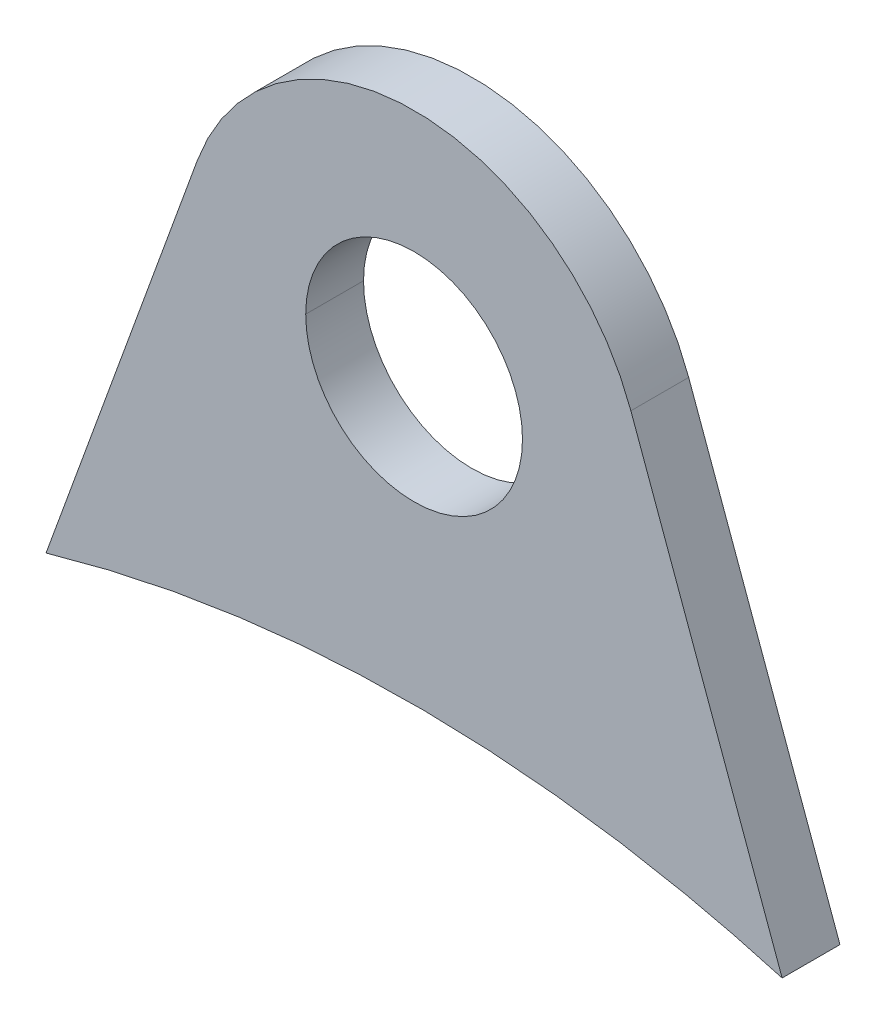
ISO-10303-21;
HEADER;
FILE_DESCRIPTION(('STEP AP214'),'2;1');
FILE_NAME('part.step','',(''),(''),'','','');
FILE_SCHEMA(('AUTOMOTIVE_DESIGN { 1 0 10303 214 1 1 1 1 }'));
ENDSEC;
DATA;
#1=APPLICATION_CONTEXT('core data for automotive mechanical design processes');
#2=APPLICATION_PROTOCOL_DEFINITION('international standard','automotive_design',2000,#1);
#3=PRODUCT_CONTEXT('',#1,'mechanical');
#4=PRODUCT('Part','Part','',(#3));
#5=PRODUCT_RELATED_PRODUCT_CATEGORY('part','',(#4));
#6=PRODUCT_DEFINITION_FORMATION('','',#4);
#7=PRODUCT_DEFINITION_CONTEXT('part definition',#1,'design');
#8=PRODUCT_DEFINITION('design','',#6,#7);
#9=PRODUCT_DEFINITION_SHAPE('','',#8);
#10=(LENGTH_UNIT() NAMED_UNIT(*) SI_UNIT(.MILLI.,.METRE.));
#11=(NAMED_UNIT(*) PLANE_ANGLE_UNIT() SI_UNIT($,.RADIAN.));
#12=(NAMED_UNIT(*) SI_UNIT($,.STERADIAN.) SOLID_ANGLE_UNIT());
#13=UNCERTAINTY_MEASURE_WITH_UNIT(LENGTH_MEASURE(1.E-05),#10,'distance_accuracy_value','');
#14=(GEOMETRIC_REPRESENTATION_CONTEXT(3) GLOBAL_UNCERTAINTY_ASSIGNED_CONTEXT((#13)) GLOBAL_UNIT_ASSIGNED_CONTEXT((#10,
#11,#12)) REPRESENTATION_CONTEXT('',''));
#15=CARTESIAN_POINT('',(0.,0.,0.));
#16=DIRECTION('',(0.,0.,1.));
#17=DIRECTION('',(1.,0.,0.));
#18=AXIS2_PLACEMENT_3D('',#15,#16,#17);
#19=CARTESIAN_POINT('',(237.51196147364,-296.982955426362,4.8884324645745E-12));
#20=DIRECTION('',(0.689605532614526,0.72418520378936,0.));
#21=DIRECTION('',(-0.512076268434414,0.487624748455489,-0.707106781186553));
#22=AXIS2_PLACEMENT_3D('',#19,#20,#21);
#23=TOROIDAL_SURFACE('',#22,328.,181.5);
#24=CARTESIAN_POINT('',(50.7061588567481,103.465463207246,4.));
#25=CARTESIAN_POINT('',(50.8043560138858,103.439726310506,3.38985638226352));
#26=CARTESIAN_POINT('',(50.8800297766225,103.419816936708,2.77674567943645));
#27=CARTESIAN_POINT('',(50.9331187111239,103.405836050411,2.16065704182647));
#28=(BOUNDED_CURVE() B_SPLINE_CURVE(3,(#24,#25,#26,#27),.UNSPECIFIED.,.F.,
.F.) B_SPLINE_CURVE_WITH_KNOTS((4,4),(2.02602846316663E-07,0.00185445411884371),
.UNSPECIFIED.) CURVE() GEOMETRIC_REPRESENTATION_ITEM() RATIONAL_B_SPLINE_CURVE((1.,1.,1.,1.)) REPRESENTATION_ITEM(''));
#29=CARTESIAN_POINT('',(50.706158856748,103.465463207245,3.99999999999996));
#30=VERTEX_POINT('',#29);
#31=CARTESIAN_POINT('',(50.9331187111239,103.405836050411,2.16065704182647));
#32=VERTEX_POINT('',#31);
#33=EDGE_CURVE('E191',#30,#32,#28,.T.);
#34=ORIENTED_EDGE('',*,*,#33,.F.);
#35=CARTESIAN_POINT('',(-50.9331187111229,103.405836050412,3.99999999999993));
#36=CARTESIAN_POINT('',(-48.4554874316051,104.130085725674,3.99999999999993));
#37=CARTESIAN_POINT('',(-45.962388443714,104.801410169952,3.99999999999993));
#38=CARTESIAN_POINT('',(-40.9498127506451,106.037145102481,3.99999999999993));
#39=CARTESIAN_POINT('',(-38.4303358460193,106.601554781713,3.99999999999993));
#40=CARTESIAN_POINT('',(-33.3691560762587,107.622475173788,3.99999999999993));
#41=CARTESIAN_POINT('',(-30.8274493923167,108.078966954496,3.99999999999992));
#42=CARTESIAN_POINT('',(-25.7269015017919,108.883100152258,3.99999999999992));
#43=CARTESIAN_POINT('',(-23.1680604929814,109.230742823496,3.99999999999992));
#44=CARTESIAN_POINT('',(-18.0976552647974,109.809723605772,3.99999999999992));
#45=CARTESIAN_POINT('',(-15.5863785846829,110.043582769014,3.99999999999992));
#46=CARTESIAN_POINT('',(-10.5562643496427,110.406461640258,3.99999999999992));
#47=CARTESIAN_POINT('',(-8.03742680006379,110.53548142238,3.99999999999992));
#48=CARTESIAN_POINT('',(-2.99721715390441,110.688434022884,3.99999999999992));
#49=CARTESIAN_POINT('',(-0.475845909116226,110.712394768461,3.99999999999992));
#50=CARTESIAN_POINT('',(4.56549841829066,110.655276623094,3.99999999999992));
#51=CARTESIAN_POINT('',(7.08547157214515,110.574203694047,3.99999999999992));
#52=CARTESIAN_POINT('',(13.051807129857,110.257706439248,3.99999999999992));
#53=CARTESIAN_POINT('',(16.495835452445,109.976259544864,3.99999999999992));
#54=CARTESIAN_POINT('',(23.3614712063354,109.217399483765,3.99999999999992));
#55=CARTESIAN_POINT('',(26.783082269814,108.740018903233,3.99999999999992));
#56=CARTESIAN_POINT('',(33.6493712780839,107.581388912209,3.99999999999992));
#57=CARTESIAN_POINT('',(37.0935134325297,106.896937551424,3.99999999999992));
#58=CARTESIAN_POINT('',(42.2255157604996,105.721407591173,3.99999999999992));
#59=CARTESIAN_POINT('',(43.9307273137416,105.304683892412,3.99999999999992));
#60=CARTESIAN_POINT('',(47.3283507105477,104.421953788328,3.99999999999992));
#61=CARTESIAN_POINT('',(49.0207625237648,103.955947266198,3.99999999999992));
#62=CARTESIAN_POINT('',(50.7061588567479,103.465463207245,3.99999999999992));
#63=B_SPLINE_CURVE_WITH_KNOTS('',3,(#35,#36,#37,#38,#39,#40,#41,#42,#43,#44,#45,#46,#47,#48,#49,
#50,#51,#52,#53,#54,#55,#56,#57,#58,#59,#60,#61,#62),.UNSPECIFIED.,.F.,.F.,(4,2,2,2,2,2,2,2,2,2,
2,2,2,4),(0.,7.74335816604237,15.4867749233011,23.2315491087713,30.976234053966,
38.5404765295411,46.1047136572073,53.666939908559,61.2287369333531,71.5893154197241,
81.9481715121978,92.4761918431155,97.7417364389047,103.007293514925),.UNSPECIFIED.);
#64=CARTESIAN_POINT('',(-50.9331187111228,103.405836050411,3.99999999999996));
#65=VERTEX_POINT('',#64);
#66=EDGE_CURVE('E21',#65,#30,#63,.T.);
#67=ORIENTED_EDGE('',*,*,#66,.F.);
#68=CARTESIAN_POINT('',(-50.9331187111228,103.405836050412,-4.));
#69=CARTESIAN_POINT('',(-50.925045095001,103.428018128399,-1.33333333333336));
#70=CARTESIAN_POINT('',(-50.925045095001,103.428018128399,1.3333333333333));
#71=CARTESIAN_POINT('',(-50.9331187111227,103.405836050411,4.));
#72=(BOUNDED_CURVE() B_SPLINE_CURVE(3,(#68,#69,#70,#71),.UNSPECIFIED.,.F.,
.F.) B_SPLINE_CURVE_WITH_KNOTS((4,4),(2.00000000005751E-07,0.0080002),
.UNSPECIFIED.) CURVE() GEOMETRIC_REPRESENTATION_ITEM() RATIONAL_B_SPLINE_CURVE((1.,1.,1.,1.)) REPRESENTATION_ITEM(''));
#73=CARTESIAN_POINT('',(-50.9331187111221,103.405836050412,-4.00000000000009));
#74=VERTEX_POINT('',#73);
#75=EDGE_CURVE('E11',#74,#65,#72,.T.);
#76=ORIENTED_EDGE('',*,*,#75,.F.);
#77=CARTESIAN_POINT('',(-50.9331187111227,103.405836050412,-4.00000000000007));
#78=CARTESIAN_POINT('',(-48.455487431605,104.130085725674,-4.00000000000007));
#79=CARTESIAN_POINT('',(-45.9623884437138,104.801410169952,-4.00000000000007));
#80=CARTESIAN_POINT('',(-40.9498127506449,106.037145102481,-4.00000000000007));
#81=CARTESIAN_POINT('',(-38.4303358460191,106.601554781713,-4.00000000000007));
#82=CARTESIAN_POINT('',(-33.3691560762585,107.622475173788,-4.00000000000007));
#83=CARTESIAN_POINT('',(-30.8274493923166,108.078966954496,-4.00000000000008));
#84=CARTESIAN_POINT('',(-25.7269015017917,108.883100152258,-4.00000000000008));
#85=CARTESIAN_POINT('',(-23.1680604929813,109.230742823496,-4.00000000000008));
#86=CARTESIAN_POINT('',(-18.0976552647973,109.809723605772,-4.00000000000008));
#87=CARTESIAN_POINT('',(-15.5863785846828,110.043582769014,-4.00000000000008));
#88=CARTESIAN_POINT('',(-10.5562643496426,110.406461640258,-4.00000000000008));
#89=CARTESIAN_POINT('',(-8.03742680006362,110.53548142238,-4.00000000000008));
#90=CARTESIAN_POINT('',(-2.99721715390422,110.688434022884,-4.00000000000008));
#91=CARTESIAN_POINT('',(-0.47584590911602,110.712394768461,-4.00000000000008));
#92=CARTESIAN_POINT('',(4.56549841829088,110.655276623094,-4.00000000000008));
#93=CARTESIAN_POINT('',(7.08547157214538,110.574203694047,-4.00000000000008));
#94=CARTESIAN_POINT('',(13.0518071298552,110.257706439248,-4.00000000000008));
#95=CARTESIAN_POINT('',(16.495835452441,109.976259544864,-4.00000000000008));
#96=CARTESIAN_POINT('',(23.3614712063273,109.217399483766,-4.00000000000008));
#97=CARTESIAN_POINT('',(26.7830822698038,108.740018903234,-4.00000000000008));
#98=CARTESIAN_POINT('',(33.6493712780695,107.581388912212,-4.00000000000008));
#99=CARTESIAN_POINT('',(37.0935134325131,106.896937551428,-4.00000000000008));
#100=CARTESIAN_POINT('',(42.2255157604799,105.721407591178,-4.00000000000008));
#101=CARTESIAN_POINT('',(43.9307273137209,105.304683892418,-4.00000000000008));
#102=CARTESIAN_POINT('',(47.328350710525,104.421953788334,-4.00000000000008));
#103=CARTESIAN_POINT('',(49.0207625237411,103.955947266204,-4.00000000000008));
#104=CARTESIAN_POINT('',(50.7061588567232,103.465463207252,-4.00000000000008));
#105=B_SPLINE_CURVE_WITH_KNOTS('',3,(#77,#78,#79,#80,#81,#82,#83,#84,#85,#86,#87,#88,#89,#90,
#91,#92,#93,#94,#95,#96,#97,#98,#99,#100,#101,#102,#103,#104),.UNSPECIFIED.,.F.,.F.,(4,2,2,2,2,
2,2,2,2,2,2,2,2,4),(0.,7.74335816604237,15.486774923301,23.2315491087712,30.9762340539659,
38.540476529541,46.1047136572073,53.666939908559,61.2287369333532,71.5893154197178,
81.9481715121851,92.4761918430962,97.7417364388821,103.007293514899),.UNSPECIFIED.);
#106=CARTESIAN_POINT('',(50.7061588567232,103.465463207252,-4.00000000000004));
#107=VERTEX_POINT('',#106);
#108=EDGE_CURVE('E175',#74,#107,#105,.T.);
#109=ORIENTED_EDGE('',*,*,#108,.T.);
#110=CARTESIAN_POINT('',(50.9331187111249,103.405836050411,-2.16065704181354));
#111=CARTESIAN_POINT('',(50.8800297766202,103.419816936709,-2.77674567945287));
#112=CARTESIAN_POINT('',(50.8043560138851,103.439726310506,-3.38985638227217));
#113=CARTESIAN_POINT('',(50.7061588567233,103.465463207253,-4.));
#114=(BOUNDED_CURVE() B_SPLINE_CURVE(3,(#110,#111,#112,#113),.UNSPECIFIED.,.F.,
.F.) B_SPLINE_CURVE_WITH_KNOTS((4,4),(2.32973149421561E-06,0.00185658124746788),
.UNSPECIFIED.) CURVE() GEOMETRIC_REPRESENTATION_ITEM() RATIONAL_B_SPLINE_CURVE((1.,1.,1.,1.)) REPRESENTATION_ITEM(''));
#115=CARTESIAN_POINT('',(50.9331187111249,103.405836050411,-2.16065704181354));
#116=VERTEX_POINT('',#115);
#117=EDGE_CURVE('E153',#116,#107,#114,.T.);
#118=ORIENTED_EDGE('',*,*,#117,.F.);
#119=CARTESIAN_POINT('',(50.9331187111239,103.405836050411,2.16065704182647));
#120=CARTESIAN_POINT('',(50.9316457595424,103.40988295162,0.720219013938378));
#121=CARTESIAN_POINT('',(50.9316457595424,103.40988295162,-0.72021901395244));
#122=CARTESIAN_POINT('',(50.9331187111249,103.405836050411,-2.16065704181354));
#123=B_SPLINE_CURVE_WITH_KNOTS('',3,(#119,#120,#121,#122),.UNSPECIFIED.,.F.,.F.,(4,4),(0.,1.),.UNSPECIFIED.);
#124=EDGE_CURVE('E48',#32,#116,#123,.T.);
#125=ORIENTED_EDGE('',*,*,#124,.F.);
#126=EDGE_LOOP('',(#34,#67,#76,#109,#118,#125));
#127=FACE_BOUND('',#126,.T.);
#128=ADVANCED_FACE('F17',(#127),#23,.F.);
#129=CARTESIAN_POINT('',(3.33066907387547E-13,150.,4.));
#130=DIRECTION('',(0.,0.,-1.));
#131=DIRECTION('',(-1.,0.,0.));
#132=AXIS2_PLACEMENT_3D('',#129,#130,#131);
#133=CYLINDRICAL_SURFACE('',#132,15.);
#134=DIRECTION('',(0.,0.,-1.));
#135=VECTOR('',#134,1.);
#136=CARTESIAN_POINT('',(15.0000000000003,150.,4.));
#137=LINE('',#136,#135);
#138=CARTESIAN_POINT('',(15.0000000000003,150.,4.));
#139=VERTEX_POINT('',#138);
#140=CARTESIAN_POINT('',(15.0000000000008,150.,-4.));
#141=VERTEX_POINT('',#140);
#142=EDGE_CURVE('E123',#139,#141,#137,.T.);
#143=ORIENTED_EDGE('',*,*,#142,.F.);
#144=CARTESIAN_POINT('',(3.33066907387547E-13,150.,4.));
#145=DIRECTION('',(0.,0.,1.));
#146=DIRECTION('',(1.,0.,0.));
#147=AXIS2_PLACEMENT_3D('',#144,#145,#146);
#148=CIRCLE('',#147,15.);
#149=CARTESIAN_POINT('',(-14.9999999999997,150.,4.));
#150=VERTEX_POINT('',#149);
#151=EDGE_CURVE('E217',#139,#150,#148,.T.);
#152=ORIENTED_EDGE('',*,*,#151,.T.);
#153=DIRECTION('',(0.,0.,-1.));
#154=VECTOR('',#153,1.);
#155=CARTESIAN_POINT('',(-14.9999999999996,150.,4.));
#156=LINE('',#155,#154);
#157=CARTESIAN_POINT('',(-14.9999999999992,150.,-4.));
#158=VERTEX_POINT('',#157);
#159=EDGE_CURVE('E126',#150,#158,#156,.T.);
#160=ORIENTED_EDGE('',*,*,#159,.T.);
#161=CARTESIAN_POINT('',(7.7715611723761E-13,150.,-4.));
#162=DIRECTION('',(0.,0.,1.));
#163=DIRECTION('',(1.,0.,0.));
#164=AXIS2_PLACEMENT_3D('',#161,#162,#163);
#165=CIRCLE('',#164,15.);
#166=EDGE_CURVE('E119',#141,#158,#165,.T.);
#167=ORIENTED_EDGE('',*,*,#166,.F.);
#168=EDGE_LOOP('',(#143,#152,#160,#167));
#169=FACE_BOUND('',#168,.T.);
#170=ADVANCED_FACE('F121',(#169),#133,.F.);
#171=CARTESIAN_POINT('',(-50.9331187111227,103.405836050411,4.));
#172=DIRECTION('',(0.93969262078591,-0.342020143325665,0.));
#173=DIRECTION('',(0.,0.,-1.));
#174=AXIS2_PLACEMENT_3D('',#171,#172,#173);
#175=PLANE('',#174);
#176=DIRECTION('',(-0.342020143325665,-0.93969262078591,0.));
#177=VECTOR('',#176,1.);
#178=CARTESIAN_POINT('',(-50.9331187111218,103.40583605041,-4.00000000000017));
#179=LINE('',#178,#177);
#180=CARTESIAN_POINT('',(-30.,160.919107027986,-4.));
#181=VERTEX_POINT('',#180);
#182=EDGE_CURVE('E169',#181,#74,#179,.T.);
#183=ORIENTED_EDGE('',*,*,#182,.T.);
#184=ORIENTED_EDGE('',*,*,#75,.T.);
#185=DIRECTION('',(-0.342020143325665,-0.93969262078591,0.));
#186=VECTOR('',#185,1.);
#187=CARTESIAN_POINT('',(-50.9331187111227,103.405836050411,4.));
#188=LINE('',#187,#186);
#189=CARTESIAN_POINT('',(-30.,160.919107027986,4.00000000000006));
#190=VERTEX_POINT('',#189);
#191=EDGE_CURVE('E186',#190,#65,#188,.T.);
#192=ORIENTED_EDGE('',*,*,#191,.F.);
#193=DIRECTION('',(0.,0.,-1.));
#194=VECTOR('',#193,1.);
#195=CARTESIAN_POINT('',(-30.,160.919107027986,4.00000000000006));
#196=LINE('',#195,#194);
#197=EDGE_CURVE('E33',#190,#181,#196,.T.);
#198=ORIENTED_EDGE('',*,*,#197,.T.);
#199=EDGE_LOOP('',(#183,#184,#192,#198));
#200=FACE_BOUND('',#199,.T.);
#201=ADVANCED_FACE('F228',(#200),#175,.F.);
#202=CARTESIAN_POINT('',(3.33066907387547E-13,150.,4.));
#203=DIRECTION('',(0.,0.,-1.));
#204=DIRECTION('',(-1.,0.,0.));
#205=AXIS2_PLACEMENT_3D('',#202,#203,#204);
#206=CYLINDRICAL_SURFACE('',#205,31.9253331742772);
#207=CARTESIAN_POINT('',(7.7715611723761E-13,150.,-4.));
#208=DIRECTION('',(0.,0.,1.));
#209=DIRECTION('',(1.,0.,0.));
#210=AXIS2_PLACEMENT_3D('',#207,#208,#209);
#211=CIRCLE('',#210,31.9253331742772);
#212=CARTESIAN_POINT('',(30.0000000000005,160.919107027986,-4.));
#213=VERTEX_POINT('',#212);
#214=EDGE_CURVE('E163',#213,#181,#211,.T.);
#215=ORIENTED_EDGE('',*,*,#214,.T.);
#216=ORIENTED_EDGE('',*,*,#197,.F.);
#217=CARTESIAN_POINT('',(3.33066907387547E-13,150.,4.));
#218=DIRECTION('',(0.,0.,1.));
#219=DIRECTION('',(1.,0.,0.));
#220=AXIS2_PLACEMENT_3D('',#217,#218,#219);
#221=CIRCLE('',#220,31.9253331742772);
#222=CARTESIAN_POINT('',(30.000000000002,160.919107027987,4.));
#223=VERTEX_POINT('',#222);
#224=EDGE_CURVE('E158',#223,#190,#221,.T.);
#225=ORIENTED_EDGE('',*,*,#224,.F.);
#226=DIRECTION('',(0.,0.,-1.));
#227=VECTOR('',#226,1.);
#228=CARTESIAN_POINT('',(30.000000000002,160.919107027987,4.));
#229=LINE('',#228,#227);
#230=EDGE_CURVE('E164',#223,#213,#229,.T.);
#231=ORIENTED_EDGE('',*,*,#230,.T.);
#232=EDGE_LOOP('',(#215,#216,#225,#231));
#233=FACE_BOUND('',#232,.T.);
#234=ADVANCED_FACE('F224',(#233),#206,.T.);
#235=CARTESIAN_POINT('',(50.9331187111232,103.405836050411,4.));
#236=DIRECTION('',(-0.939692620785912,-0.342020143325658,0.));
#237=DIRECTION('',(-0.342020143325658,0.939692620785912,0.));
#238=AXIS2_PLACEMENT_3D('',#235,#236,#237);
#239=PLANE('',#238);
#240=DIRECTION('',(0.,0.,-1.));
#241=VECTOR('',#240,1.);
#242=CARTESIAN_POINT('',(50.9331187111232,103.405836050411,4.));
#243=LINE('',#242,#241);
#244=CARTESIAN_POINT('',(50.9331187111232,103.405836050411,4.));
#245=VERTEX_POINT('',#244);
#246=EDGE_CURVE('E190',#245,#32,#243,.T.);
#247=ORIENTED_EDGE('',*,*,#246,.T.);
#248=ORIENTED_EDGE('',*,*,#124,.T.);
#249=DIRECTION('',(0.,0.,-1.));
#250=VECTOR('',#249,1.);
#251=CARTESIAN_POINT('',(50.9331187111232,103.405836050411,4.));
#252=LINE('',#251,#250);
#253=CARTESIAN_POINT('',(50.9331187111233,103.405836050411,-4.));
#254=VERTEX_POINT('',#253);
#255=EDGE_CURVE('E130',#116,#254,#252,.T.);
#256=ORIENTED_EDGE('',*,*,#255,.T.);
#257=DIRECTION('',(-0.342020143325658,0.939692620785912,0.));
#258=VECTOR('',#257,1.);
#259=CARTESIAN_POINT('',(50.9331187111233,103.405836050411,-4.));
#260=LINE('',#259,#258);
#261=EDGE_CURVE('E159',#254,#213,#260,.T.);
#262=ORIENTED_EDGE('',*,*,#261,.T.);
#263=ORIENTED_EDGE('',*,*,#230,.F.);
#264=DIRECTION('',(-0.342020143325658,0.939692620785912,0.));
#265=VECTOR('',#264,1.);
#266=CARTESIAN_POINT('',(50.9331187111232,103.405836050411,4.));
#267=LINE('',#266,#265);
#268=EDGE_CURVE('E154',#245,#223,#267,.T.);
#269=ORIENTED_EDGE('',*,*,#268,.F.);
#270=EDGE_LOOP('',(#247,#248,#256,#262,#263,#269));
#271=FACE_BOUND('',#270,.T.);
#272=ADVANCED_FACE('F227',(#271),#239,.F.);
#273=CARTESIAN_POINT('',(6.66133814775094E-13,-90.0000000000014,4.));
#274=DIRECTION('',(0.,0.,-1.));
#275=DIRECTION('',(-1.,0.,0.));
#276=AXIS2_PLACEMENT_3D('',#273,#274,#275);
#277=CYLINDRICAL_SURFACE('',#276,200.);
#278=ORIENTED_EDGE('',*,*,#255,.F.);
#279=ORIENTED_EDGE('',*,*,#117,.T.);
#280=CARTESIAN_POINT('',(0.,-90.,-4.));
#281=DIRECTION('',(0.,0.,-1.));
#282=DIRECTION('',(-1.,0.,0.));
#283=AXIS2_PLACEMENT_3D('',#280,#281,#282);
#284=CIRCLE('',#283,200.);
#285=EDGE_CURVE('E131',#107,#254,#284,.T.);
#286=ORIENTED_EDGE('',*,*,#285,.T.);
#287=EDGE_LOOP('',(#278,#279,#286));
#288=FACE_BOUND('',#287,.T.);
#289=ADVANCED_FACE('F234',(#288),#277,.F.);
#290=CARTESIAN_POINT('',(0.,-90.,-4.));
#291=DIRECTION('',(0.,0.,-1.));
#292=DIRECTION('',(0.,-1.,0.));
#293=AXIS2_PLACEMENT_3D('',#290,#291,#292);
#294=PLANE('',#293);
#295=CARTESIAN_POINT('',(7.7715611723761E-13,150.,-4.));
#296=DIRECTION('',(0.,0.,1.));
#297=DIRECTION('',(1.,0.,0.));
#298=AXIS2_PLACEMENT_3D('',#295,#296,#297);
#299=CIRCLE('',#298,15.);
#300=EDGE_CURVE('E133',#158,#141,#299,.T.);
#301=ORIENTED_EDGE('',*,*,#300,.T.);
#302=ORIENTED_EDGE('',*,*,#166,.T.);
#303=EDGE_LOOP('',(#301,#302));
#304=FACE_BOUND('',#303,.T.);
#305=ORIENTED_EDGE('',*,*,#108,.F.);
#306=ORIENTED_EDGE('',*,*,#182,.F.);
#307=ORIENTED_EDGE('',*,*,#214,.F.);
#308=ORIENTED_EDGE('',*,*,#261,.F.);
#309=ORIENTED_EDGE('',*,*,#285,.F.);
#310=EDGE_LOOP('',(#305,#306,#307,#308,#309));
#311=FACE_BOUND('',#310,.T.);
#312=ADVANCED_FACE('F134',(#304,#311),#294,.T.);
#313=CARTESIAN_POINT('',(6.66133814775094E-13,-90.0000000000014,4.));
#314=DIRECTION('',(0.,0.,-1.));
#315=DIRECTION('',(0.,-1.,0.));
#316=AXIS2_PLACEMENT_3D('',#313,#314,#315);
#317=PLANE('',#316);
#318=CARTESIAN_POINT('',(3.33066907387547E-13,150.,4.));
#319=DIRECTION('',(0.,0.,1.));
#320=DIRECTION('',(1.,0.,0.));
#321=AXIS2_PLACEMENT_3D('',#318,#319,#320);
#322=CIRCLE('',#321,15.);
#323=EDGE_CURVE('E140',#150,#139,#322,.T.);
#324=ORIENTED_EDGE('',*,*,#323,.F.);
#325=ORIENTED_EDGE('',*,*,#151,.F.);
#326=EDGE_LOOP('',(#324,#325));
#327=FACE_BOUND('',#326,.T.);
#328=ORIENTED_EDGE('',*,*,#191,.T.);
#329=ORIENTED_EDGE('',*,*,#66,.T.);
#330=CARTESIAN_POINT('',(6.66133814775094E-13,-90.0000000000014,4.));
#331=DIRECTION('',(0.,0.,-1.));
#332=DIRECTION('',(-1.,0.,0.));
#333=AXIS2_PLACEMENT_3D('',#330,#331,#332);
#334=CIRCLE('',#333,200.);
#335=EDGE_CURVE('E197',#30,#245,#334,.T.);
#336=ORIENTED_EDGE('',*,*,#335,.T.);
#337=ORIENTED_EDGE('',*,*,#268,.T.);
#338=ORIENTED_EDGE('',*,*,#224,.T.);
#339=EDGE_LOOP('',(#328,#329,#336,#337,#338));
#340=FACE_BOUND('',#339,.T.);
#341=ADVANCED_FACE('F257',(#327,#340),#317,.F.);
#342=CARTESIAN_POINT('',(6.66133814775094E-13,-90.0000000000014,4.));
#343=DIRECTION('',(0.,0.,-1.));
#344=DIRECTION('',(-1.,0.,0.));
#345=AXIS2_PLACEMENT_3D('',#342,#343,#344);
#346=CYLINDRICAL_SURFACE('',#345,200.);
#347=ORIENTED_EDGE('',*,*,#335,.F.);
#348=ORIENTED_EDGE('',*,*,#33,.T.);
#349=ORIENTED_EDGE('',*,*,#246,.F.);
#350=EDGE_LOOP('',(#347,#348,#349));
#351=FACE_BOUND('',#350,.T.);
#352=ADVANCED_FACE('F260',(#351),#346,.F.);
#353=CARTESIAN_POINT('',(3.33066907387547E-13,150.,4.));
#354=DIRECTION('',(0.,0.,-1.));
#355=DIRECTION('',(-1.,0.,0.));
#356=AXIS2_PLACEMENT_3D('',#353,#354,#355);
#357=CYLINDRICAL_SURFACE('',#356,15.);
#358=ORIENTED_EDGE('',*,*,#323,.T.);
#359=ORIENTED_EDGE('',*,*,#142,.T.);
#360=ORIENTED_EDGE('',*,*,#300,.F.);
#361=ORIENTED_EDGE('',*,*,#159,.F.);
#362=EDGE_LOOP('',(#358,#359,#360,#361));
#363=FACE_BOUND('',#362,.T.);
#364=ADVANCED_FACE('F19',(#363),#357,.F.);
#365=CLOSED_SHELL('',(#128,#170,#201,#234,#272,#289,#312,#341,#352,#364));
#366=MANIFOLD_SOLID_BREP('B1',#365);
#367=ADVANCED_BREP_SHAPE_REPRESENTATION('',(#18,#366),#14);
#368=SHAPE_DEFINITION_REPRESENTATION(#9,#367);
ENDSEC;
END-ISO-10303-21;
